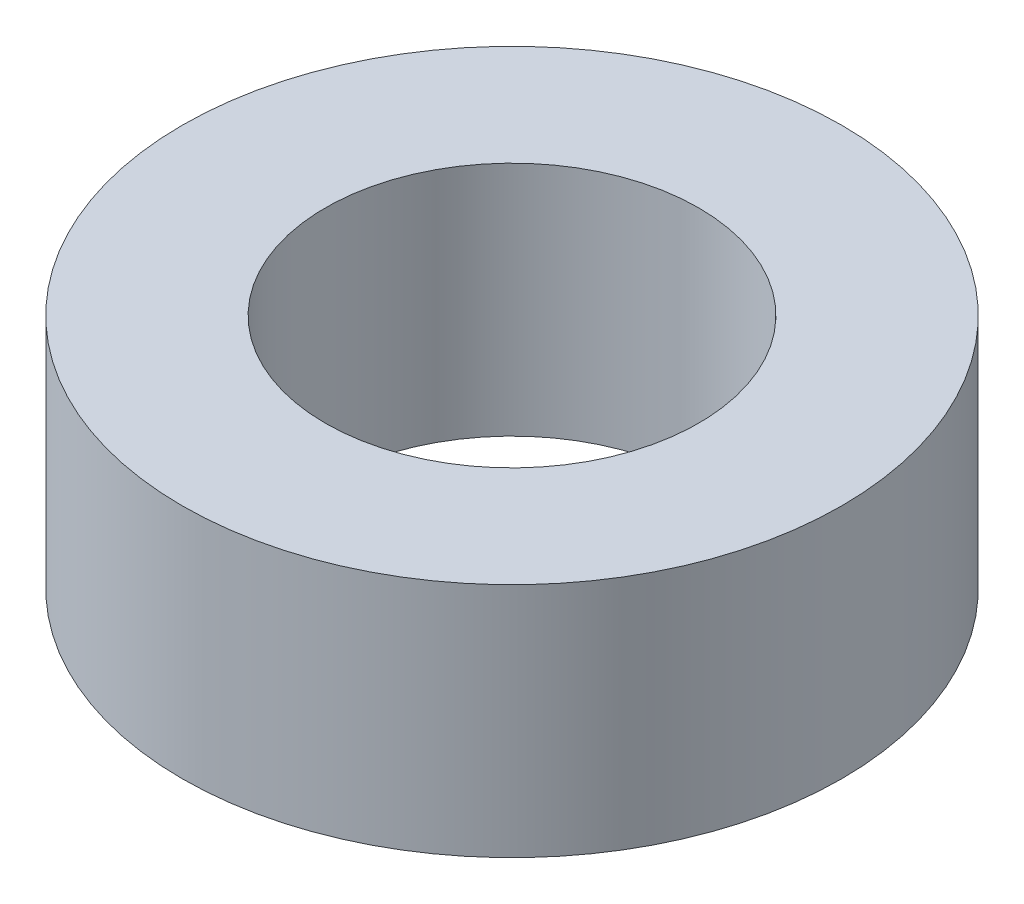
ISO-10303-21;
HEADER;
FILE_DESCRIPTION(('STEP AP214'),'2;1');
FILE_NAME('part.step','',(''),(''),'','','');
FILE_SCHEMA(('AUTOMOTIVE_DESIGN { 1 0 10303 214 1 1 1 1 }'));
ENDSEC;
DATA;
#1=APPLICATION_CONTEXT('core data for automotive mechanical design processes');
#2=APPLICATION_PROTOCOL_DEFINITION('international standard','automotive_design',2000,#1);
#3=PRODUCT_CONTEXT('',#1,'mechanical');
#4=PRODUCT('Part','Part','',(#3));
#5=PRODUCT_RELATED_PRODUCT_CATEGORY('part','',(#4));
#6=PRODUCT_DEFINITION_FORMATION('','',#4);
#7=PRODUCT_DEFINITION_CONTEXT('part definition',#1,'design');
#8=PRODUCT_DEFINITION('design','',#6,#7);
#9=PRODUCT_DEFINITION_SHAPE('','',#8);
#10=(LENGTH_UNIT() NAMED_UNIT(*) SI_UNIT(.MILLI.,.METRE.));
#11=(NAMED_UNIT(*) PLANE_ANGLE_UNIT() SI_UNIT($,.RADIAN.));
#12=(NAMED_UNIT(*) SI_UNIT($,.STERADIAN.) SOLID_ANGLE_UNIT());
#13=UNCERTAINTY_MEASURE_WITH_UNIT(LENGTH_MEASURE(1.E-05),#10,'distance_accuracy_value','');
#14=(GEOMETRIC_REPRESENTATION_CONTEXT(3) GLOBAL_UNCERTAINTY_ASSIGNED_CONTEXT((#13)) GLOBAL_UNIT_ASSIGNED_CONTEXT((#10,
#11,#12)) REPRESENTATION_CONTEXT('',''));
#15=CARTESIAN_POINT('',(0.,0.,0.));
#16=DIRECTION('',(0.,0.,1.));
#17=DIRECTION('',(1.,0.,0.));
#18=AXIS2_PLACEMENT_3D('',#15,#16,#17);
#19=CARTESIAN_POINT('',(0.,3.8,0.));
#20=DIRECTION('',(0.,1.,0.));
#21=DIRECTION('',(0.,0.,1.));
#22=AXIS2_PLACEMENT_3D('',#19,#20,#21);
#23=PLANE('',#22);
#24=CARTESIAN_POINT('',(0.,3.8,0.));
#25=DIRECTION('',(0.,1.,0.));
#26=DIRECTION('',(0.,0.,1.));
#27=AXIS2_PLACEMENT_3D('',#24,#25,#26);
#28=CIRCLE('',#27,5.3);
#29=CARTESIAN_POINT('',(0.,3.8,5.3));
#30=VERTEX_POINT('',#29);
#31=EDGE_CURVE('E10',#30,#30,#28,.T.);
#32=ORIENTED_EDGE('',*,*,#31,.T.);
#33=EDGE_LOOP('',(#32));
#34=FACE_BOUND('',#33,.T.);
#35=CARTESIAN_POINT('',(0.,3.8,0.));
#36=DIRECTION('',(0.,1.,0.));
#37=DIRECTION('',(0.,0.,1.));
#38=AXIS2_PLACEMENT_3D('',#35,#36,#37);
#39=CIRCLE('',#38,3.);
#40=CARTESIAN_POINT('',(0.,3.8,3.));
#41=VERTEX_POINT('',#40);
#42=EDGE_CURVE('E50',#41,#41,#39,.T.);
#43=ORIENTED_EDGE('',*,*,#42,.F.);
#44=EDGE_LOOP('',(#43));
#45=FACE_BOUND('',#44,.T.);
#46=ADVANCED_FACE('F37',(#34,#45),#23,.T.);
#47=CARTESIAN_POINT('',(0.,0.,0.));
#48=DIRECTION('',(0.,1.,0.));
#49=DIRECTION('',(0.,0.,1.));
#50=AXIS2_PLACEMENT_3D('',#47,#48,#49);
#51=PLANE('',#50);
#52=CARTESIAN_POINT('',(0.,0.,0.));
#53=DIRECTION('',(0.,1.,0.));
#54=DIRECTION('',(0.,0.,1.));
#55=AXIS2_PLACEMENT_3D('',#52,#53,#54);
#56=CIRCLE('',#55,5.3);
#57=CARTESIAN_POINT('',(0.,0.,5.3));
#58=VERTEX_POINT('',#57);
#59=EDGE_CURVE('E41',#58,#58,#56,.T.);
#60=ORIENTED_EDGE('',*,*,#59,.F.);
#61=EDGE_LOOP('',(#60));
#62=FACE_BOUND('',#61,.T.);
#63=CARTESIAN_POINT('',(0.,0.,0.));
#64=DIRECTION('',(0.,1.,0.));
#65=DIRECTION('',(0.,0.,1.));
#66=AXIS2_PLACEMENT_3D('',#63,#64,#65);
#67=CIRCLE('',#66,3.);
#68=CARTESIAN_POINT('',(0.,0.,3.));
#69=VERTEX_POINT('',#68);
#70=EDGE_CURVE('E52',#69,#69,#67,.T.);
#71=ORIENTED_EDGE('',*,*,#70,.T.);
#72=EDGE_LOOP('',(#71));
#73=FACE_BOUND('',#72,.T.);
#74=ADVANCED_FACE('F64',(#62,#73),#51,.F.);
#75=CARTESIAN_POINT('',(0.,3.8,0.));
#76=DIRECTION('',(0.,-1.,0.));
#77=DIRECTION('',(0.,0.,-1.));
#78=AXIS2_PLACEMENT_3D('',#75,#76,#77);
#79=CYLINDRICAL_SURFACE('',#78,5.3);
#80=ORIENTED_EDGE('',*,*,#31,.F.);
#81=EDGE_LOOP('',(#80));
#82=FACE_BOUND('',#81,.T.);
#83=ORIENTED_EDGE('',*,*,#59,.T.);
#84=EDGE_LOOP('',(#83));
#85=FACE_BOUND('',#84,.T.);
#86=ADVANCED_FACE('F39',(#82,#85),#79,.T.);
#87=CARTESIAN_POINT('',(0.,3.8,0.));
#88=DIRECTION('',(0.,-1.,0.));
#89=DIRECTION('',(0.,0.,-1.));
#90=AXIS2_PLACEMENT_3D('',#87,#88,#89);
#91=CYLINDRICAL_SURFACE('',#90,3.);
#92=ORIENTED_EDGE('',*,*,#42,.T.);
#93=EDGE_LOOP('',(#92));
#94=FACE_BOUND('',#93,.T.);
#95=ORIENTED_EDGE('',*,*,#70,.F.);
#96=EDGE_LOOP('',(#95));
#97=FACE_BOUND('',#96,.T.);
#98=ADVANCED_FACE('F60',(#94,#97),#91,.F.);
#99=CLOSED_SHELL('',(#46,#74,#86,#98));
#100=MANIFOLD_SOLID_BREP('B2',#99);
#101=ADVANCED_BREP_SHAPE_REPRESENTATION('',(#18,#100),#14);
#102=SHAPE_DEFINITION_REPRESENTATION(#9,#101);
ENDSEC;
END-ISO-10303-21;
